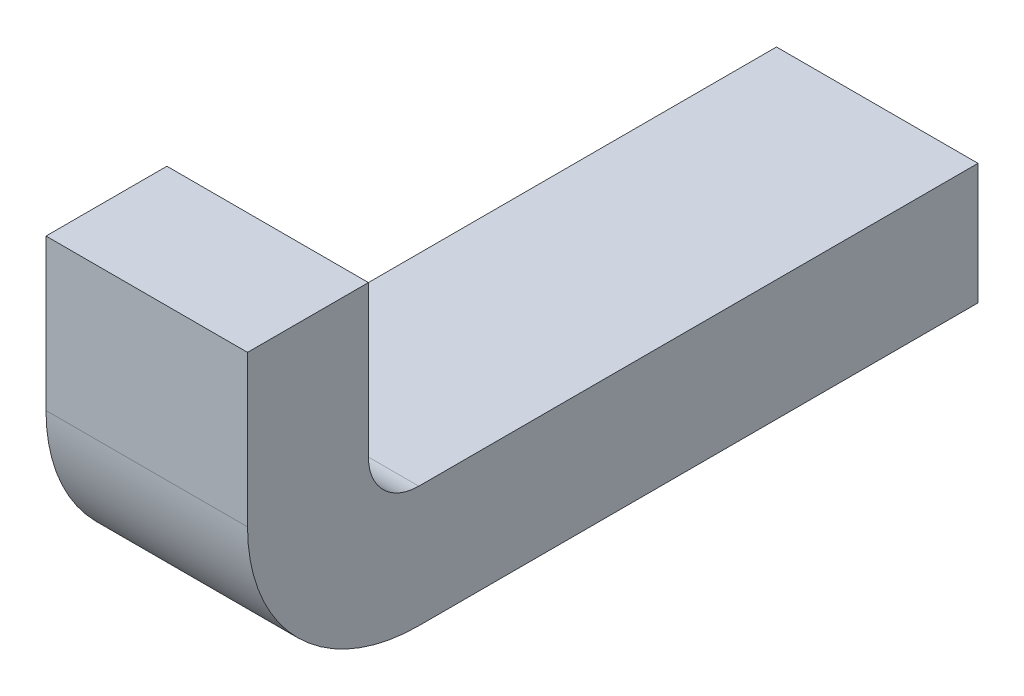
ISO-10303-21;
HEADER;
FILE_DESCRIPTION(('STEP AP214'),'2;1');
FILE_NAME('part.step','',(''),(''),'','','');
FILE_SCHEMA(('AUTOMOTIVE_DESIGN { 1 0 10303 214 1 1 1 1 }'));
ENDSEC;
DATA;
#1=APPLICATION_CONTEXT('core data for automotive mechanical design processes');
#2=APPLICATION_PROTOCOL_DEFINITION('international standard','automotive_design',2000,#1);
#3=PRODUCT_CONTEXT('',#1,'mechanical');
#4=PRODUCT('Part','Part','',(#3));
#5=PRODUCT_RELATED_PRODUCT_CATEGORY('part','',(#4));
#6=PRODUCT_DEFINITION_FORMATION('','',#4);
#7=PRODUCT_DEFINITION_CONTEXT('part definition',#1,'design');
#8=PRODUCT_DEFINITION('design','',#6,#7);
#9=PRODUCT_DEFINITION_SHAPE('','',#8);
#10=(LENGTH_UNIT() NAMED_UNIT(*) SI_UNIT(.MILLI.,.METRE.));
#11=(NAMED_UNIT(*) PLANE_ANGLE_UNIT() SI_UNIT($,.RADIAN.));
#12=(NAMED_UNIT(*) SI_UNIT($,.STERADIAN.) SOLID_ANGLE_UNIT());
#13=UNCERTAINTY_MEASURE_WITH_UNIT(LENGTH_MEASURE(1.E-05),#10,'distance_accuracy_value','');
#14=(GEOMETRIC_REPRESENTATION_CONTEXT(3) GLOBAL_UNCERTAINTY_ASSIGNED_CONTEXT((#13)) GLOBAL_UNIT_ASSIGNED_CONTEXT((#10,
#11,#12)) REPRESENTATION_CONTEXT('',''));
#15=CARTESIAN_POINT('',(0.,0.,0.));
#16=DIRECTION('',(0.,0.,1.));
#17=DIRECTION('',(1.,0.,0.));
#18=AXIS2_PLACEMENT_3D('',#15,#16,#17);
#19=CARTESIAN_POINT('',(3.21,0.17,-3.250000000002));
#20=DIRECTION('',(0.,0.,-1.));
#21=DIRECTION('',(-1.,0.,0.));
#22=AXIS2_PLACEMENT_3D('',#19,#20,#21);
#23=PLANE('',#22);
#24=DIRECTION('',(0.,1.,0.));
#25=VECTOR('',#24,1.);
#26=CARTESIAN_POINT('',(3.425,0.17,-3.250000000002));
#27=LINE('',#26,#25);
#28=CARTESIAN_POINT('',(3.425,0.17,-3.250000000002));
#29=VERTEX_POINT('',#28);
#30=CARTESIAN_POINT('',(3.425,0.32,-3.250000000002));
#31=VERTEX_POINT('',#30);
#32=EDGE_CURVE('E138',#29,#31,#27,.T.);
#33=ORIENTED_EDGE('',*,*,#32,.F.);
#34=DIRECTION('',(1.,0.,0.));
#35=VECTOR('',#34,1.);
#36=CARTESIAN_POINT('',(3.21,0.17,-3.250000000002));
#37=LINE('',#36,#35);
#38=CARTESIAN_POINT('',(3.225,0.17,-3.250000000002));
#39=VERTEX_POINT('',#38);
#40=EDGE_CURVE('E107',#29,#39,#37,.F.);
#41=ORIENTED_EDGE('',*,*,#40,.T.);
#42=DIRECTION('',(0.,1.,0.));
#43=VECTOR('',#42,1.);
#44=CARTESIAN_POINT('',(3.225,0.,-3.250000000002));
#45=LINE('',#44,#43);
#46=CARTESIAN_POINT('',(3.225,0.32,-3.250000000002));
#47=VERTEX_POINT('',#46);
#48=EDGE_CURVE('E104',#39,#47,#45,.T.);
#49=ORIENTED_EDGE('',*,*,#48,.T.);
#50=DIRECTION('',(1.,0.,0.));
#51=VECTOR('',#50,1.);
#52=CARTESIAN_POINT('',(3.21,0.32,-3.250000000002));
#53=LINE('',#52,#51);
#54=EDGE_CURVE('E131',#31,#47,#53,.F.);
#55=ORIENTED_EDGE('',*,*,#54,.F.);
#56=EDGE_LOOP('',(#33,#41,#49,#55));
#57=FACE_BOUND('',#56,.T.);
#58=ADVANCED_FACE('F16',(#57),#23,.T.);
#59=CARTESIAN_POINT('',(3.21,0.32,-3.250000000002));
#60=DIRECTION('',(0.,1.,1.246832498358E-13));
#61=DIRECTION('',(0.,-1.246832498358E-13,1.));
#62=AXIS2_PLACEMENT_3D('',#59,#60,#61);
#63=PLANE('',#62);
#64=DIRECTION('',(0.,0.,-1.));
#65=VECTOR('',#64,1.);
#66=CARTESIAN_POINT('',(3.425,0.32,-3.300000000002));
#67=LINE('',#66,#65);
#68=CARTESIAN_POINT('',(3.425,0.32,-3.130000000002));
#69=VERTEX_POINT('',#68);
#70=EDGE_CURVE('E134',#31,#69,#67,.F.);
#71=ORIENTED_EDGE('',*,*,#70,.F.);
#72=ORIENTED_EDGE('',*,*,#54,.T.);
#73=DIRECTION('',(0.,0.,1.));
#74=VECTOR('',#73,1.);
#75=CARTESIAN_POINT('',(3.225,0.32,3.855));
#76=LINE('',#75,#74);
#77=CARTESIAN_POINT('',(3.225,0.32,-3.130000000002));
#78=VERTEX_POINT('',#77);
#79=EDGE_CURVE('E98',#47,#78,#76,.T.);
#80=ORIENTED_EDGE('',*,*,#79,.T.);
#81=DIRECTION('',(1.,0.,0.));
#82=VECTOR('',#81,1.);
#83=CARTESIAN_POINT('',(3.21,0.32,-3.130000000002));
#84=LINE('',#83,#82);
#85=EDGE_CURVE('E129',#69,#78,#84,.F.);
#86=ORIENTED_EDGE('',*,*,#85,.F.);
#87=EDGE_LOOP('',(#71,#72,#80,#86));
#88=FACE_BOUND('',#87,.T.);
#89=ADVANCED_FACE('F188',(#88),#63,.T.);
#90=CARTESIAN_POINT('',(3.21,0.32,-3.130000000002));
#91=DIRECTION('',(0.,0.,1.));
#92=DIRECTION('',(1.,0.,0.));
#93=AXIS2_PLACEMENT_3D('',#90,#91,#92);
#94=PLANE('',#93);
#95=DIRECTION('',(0.,1.,0.));
#96=VECTOR('',#95,1.);
#97=CARTESIAN_POINT('',(3.425,0.17,-3.130000000002));
#98=LINE('',#97,#96);
#99=CARTESIAN_POINT('',(3.425,0.17,-3.130000000002));
#100=VERTEX_POINT('',#99);
#101=EDGE_CURVE('E137',#69,#100,#98,.F.);
#102=ORIENTED_EDGE('',*,*,#101,.F.);
#103=ORIENTED_EDGE('',*,*,#85,.T.);
#104=DIRECTION('',(0.,1.,0.));
#105=VECTOR('',#104,1.);
#106=CARTESIAN_POINT('',(3.225,0.,-3.130000000002));
#107=LINE('',#106,#105);
#108=CARTESIAN_POINT('',(3.225,0.17,-3.130000000002));
#109=VERTEX_POINT('',#108);
#110=EDGE_CURVE('E78',#78,#109,#107,.F.);
#111=ORIENTED_EDGE('',*,*,#110,.T.);
#112=DIRECTION('',(1.,0.,0.));
#113=VECTOR('',#112,1.);
#114=CARTESIAN_POINT('',(3.21,0.17,-3.130000000002));
#115=LINE('',#114,#113);
#116=EDGE_CURVE('E88',#100,#109,#115,.F.);
#117=ORIENTED_EDGE('',*,*,#116,.F.);
#118=EDGE_LOOP('',(#102,#103,#111,#117));
#119=FACE_BOUND('',#118,.T.);
#120=ADVANCED_FACE('F190',(#119),#94,.T.);
#121=CARTESIAN_POINT('',(3.21,0.17,-3.300000000002));
#122=DIRECTION('',(1.,0.,0.));
#123=DIRECTION('',(0.,0.,-1.));
#124=AXIS2_PLACEMENT_3D('',#121,#122,#123);
#125=CYLINDRICAL_SURFACE('',#124,0.17);
#126=CARTESIAN_POINT('',(3.425,0.17,-3.300000000002));
#127=DIRECTION('',(1.,0.,0.));
#128=DIRECTION('',(0.,0.,-1.));
#129=AXIS2_PLACEMENT_3D('',#126,#127,#128);
#130=CIRCLE('',#129,0.17);
#131=CARTESIAN_POINT('',(3.425,0.,-3.300000000002));
#132=VERTEX_POINT('',#131);
#133=EDGE_CURVE('E149',#100,#132,#130,.T.);
#134=ORIENTED_EDGE('',*,*,#133,.F.);
#135=ORIENTED_EDGE('',*,*,#116,.T.);
#136=CARTESIAN_POINT('',(3.225,0.17,-3.300000000002));
#137=DIRECTION('',(1.,0.,0.));
#138=DIRECTION('',(0.,0.,-1.));
#139=AXIS2_PLACEMENT_3D('',#136,#137,#138);
#140=CIRCLE('',#139,0.17);
#141=CARTESIAN_POINT('',(3.225,0.,-3.300000000002));
#142=VERTEX_POINT('',#141);
#143=EDGE_CURVE('E19',#109,#142,#140,.T.);
#144=ORIENTED_EDGE('',*,*,#143,.T.);
#145=DIRECTION('',(1.,0.,0.));
#146=VECTOR('',#145,1.);
#147=CARTESIAN_POINT('',(3.21,0.,-3.300000000002));
#148=LINE('',#147,#146);
#149=EDGE_CURVE('E86',#132,#142,#148,.F.);
#150=ORIENTED_EDGE('',*,*,#149,.F.);
#151=EDGE_LOOP('',(#134,#135,#144,#150));
#152=FACE_BOUND('',#151,.T.);
#153=ADVANCED_FACE('F85',(#152),#125,.T.);
#154=CARTESIAN_POINT('',(3.21,0.,-3.300000000002));
#155=DIRECTION('',(0.,-1.,0.));
#156=DIRECTION('',(0.,0.,-1.));
#157=AXIS2_PLACEMENT_3D('',#154,#155,#156);
#158=PLANE('',#157);
#159=DIRECTION('',(0.,0.,-1.));
#160=VECTOR('',#159,1.);
#161=CARTESIAN_POINT('',(3.425,0.,-3.300000000002));
#162=LINE('',#161,#160);
#163=CARTESIAN_POINT('',(3.425,0.,-3.854999999999));
#164=VERTEX_POINT('',#163);
#165=EDGE_CURVE('E96',#132,#164,#162,.T.);
#166=ORIENTED_EDGE('',*,*,#165,.F.);
#167=ORIENTED_EDGE('',*,*,#149,.T.);
#168=DIRECTION('',(0.,0.,1.));
#169=VECTOR('',#168,1.);
#170=CARTESIAN_POINT('',(3.225,0.,3.855));
#171=LINE('',#170,#169);
#172=CARTESIAN_POINT('',(3.225,0.,-3.854999999999));
#173=VERTEX_POINT('',#172);
#174=EDGE_CURVE('E91',#142,#173,#171,.F.);
#175=ORIENTED_EDGE('',*,*,#174,.T.);
#176=DIRECTION('',(-1.,0.,0.));
#177=VECTOR('',#176,1.);
#178=CARTESIAN_POINT('',(3.21,0.,-3.854999999999));
#179=LINE('',#178,#177);
#180=EDGE_CURVE('E121',#164,#173,#179,.T.);
#181=ORIENTED_EDGE('',*,*,#180,.F.);
#182=EDGE_LOOP('',(#166,#167,#175,#181));
#183=FACE_BOUND('',#182,.T.);
#184=ADVANCED_FACE('F93',(#183),#158,.T.);
#185=CARTESIAN_POINT('',(3.225,0.,3.855));
#186=DIRECTION('',(1.,0.,0.));
#187=DIRECTION('',(0.,1.,0.));
#188=AXIS2_PLACEMENT_3D('',#185,#186,#187);
#189=PLANE('',#188);
#190=CARTESIAN_POINT('',(3.225,0.17,-3.300000000002));
#191=DIRECTION('',(1.,0.,0.));
#192=DIRECTION('',(0.,0.,-1.));
#193=AXIS2_PLACEMENT_3D('',#190,#191,#192);
#194=CIRCLE('',#193,0.05);
#195=CARTESIAN_POINT('',(3.225,0.12,-3.300000000002));
#196=VERTEX_POINT('',#195);
#197=EDGE_CURVE('E126',#39,#196,#194,.T.);
#198=ORIENTED_EDGE('',*,*,#197,.T.);
#199=DIRECTION('',(0.,0.,1.));
#200=VECTOR('',#199,1.);
#201=CARTESIAN_POINT('',(3.225,0.12,-3.854999999999));
#202=LINE('',#201,#200);
#203=CARTESIAN_POINT('',(3.225,0.12,-3.854999999999));
#204=VERTEX_POINT('',#203);
#205=EDGE_CURVE('E123',#204,#196,#202,.T.);
#206=ORIENTED_EDGE('',*,*,#205,.F.);
#207=DIRECTION('',(0.,1.,0.));
#208=VECTOR('',#207,1.);
#209=CARTESIAN_POINT('',(3.225,0.,-3.854999999999));
#210=LINE('',#209,#208);
#211=EDGE_CURVE('E102',#173,#204,#210,.T.);
#212=ORIENTED_EDGE('',*,*,#211,.F.);
#213=ORIENTED_EDGE('',*,*,#174,.F.);
#214=ORIENTED_EDGE('',*,*,#143,.F.);
#215=ORIENTED_EDGE('',*,*,#110,.F.);
#216=ORIENTED_EDGE('',*,*,#79,.F.);
#217=ORIENTED_EDGE('',*,*,#48,.F.);
#218=EDGE_LOOP('',(#198,#206,#212,#213,#214,#215,#216,#217));
#219=FACE_BOUND('',#218,.T.);
#220=ADVANCED_FACE('F100',(#219),#189,.F.);
#221=CARTESIAN_POINT('',(3.21,0.17,-3.300000000002));
#222=DIRECTION('',(1.,0.,0.));
#223=DIRECTION('',(0.,0.,-1.));
#224=AXIS2_PLACEMENT_3D('',#221,#222,#223);
#225=CYLINDRICAL_SURFACE('',#224,0.05);
#226=ORIENTED_EDGE('',*,*,#40,.F.);
#227=CARTESIAN_POINT('',(3.425,0.17,-3.300000000002));
#228=DIRECTION('',(1.,0.,0.));
#229=DIRECTION('',(0.,0.,-1.));
#230=AXIS2_PLACEMENT_3D('',#227,#228,#229);
#231=CIRCLE('',#230,0.05);
#232=CARTESIAN_POINT('',(3.425,0.12,-3.300000000002));
#233=VERTEX_POINT('',#232);
#234=EDGE_CURVE('E118',#233,#29,#231,.F.);
#235=ORIENTED_EDGE('',*,*,#234,.F.);
#236=DIRECTION('',(1.,0.,0.));
#237=VECTOR('',#236,1.);
#238=CARTESIAN_POINT('',(3.21,0.12,-3.300000000002));
#239=LINE('',#238,#237);
#240=EDGE_CURVE('E161',#196,#233,#239,.T.);
#241=ORIENTED_EDGE('',*,*,#240,.F.);
#242=ORIENTED_EDGE('',*,*,#197,.F.);
#243=EDGE_LOOP('',(#226,#235,#241,#242));
#244=FACE_BOUND('',#243,.T.);
#245=ADVANCED_FACE('F183',(#244),#225,.F.);
#246=CARTESIAN_POINT('',(3.425,0.17,-3.300000000002));
#247=DIRECTION('',(1.,0.,0.));
#248=DIRECTION('',(0.,0.,-1.));
#249=AXIS2_PLACEMENT_3D('',#246,#247,#248);
#250=PLANE('',#249);
#251=DIRECTION('',(0.,0.,1.));
#252=VECTOR('',#251,1.);
#253=CARTESIAN_POINT('',(3.425,0.12,-3.854999999999));
#254=LINE('',#253,#252);
#255=CARTESIAN_POINT('',(3.425,0.12,-3.854999999999));
#256=VERTEX_POINT('',#255);
#257=EDGE_CURVE('E25',#233,#256,#254,.F.);
#258=ORIENTED_EDGE('',*,*,#257,.F.);
#259=ORIENTED_EDGE('',*,*,#234,.T.);
#260=ORIENTED_EDGE('',*,*,#32,.T.);
#261=ORIENTED_EDGE('',*,*,#70,.T.);
#262=ORIENTED_EDGE('',*,*,#101,.T.);
#263=ORIENTED_EDGE('',*,*,#133,.T.);
#264=ORIENTED_EDGE('',*,*,#165,.T.);
#265=DIRECTION('',(0.,1.,0.));
#266=VECTOR('',#265,1.);
#267=CARTESIAN_POINT('',(3.425,0.,-3.854999999999));
#268=LINE('',#267,#266);
#269=EDGE_CURVE('E34',#256,#164,#268,.F.);
#270=ORIENTED_EDGE('',*,*,#269,.F.);
#271=EDGE_LOOP('',(#258,#259,#260,#261,#262,#263,#264,#270));
#272=FACE_BOUND('',#271,.T.);
#273=ADVANCED_FACE('F180',(#272),#250,.T.);
#274=CARTESIAN_POINT('',(3.21,0.,-3.854999999999));
#275=DIRECTION('',(0.,0.,-1.));
#276=DIRECTION('',(-1.,0.,0.));
#277=AXIS2_PLACEMENT_3D('',#274,#275,#276);
#278=PLANE('',#277);
#279=ORIENTED_EDGE('',*,*,#269,.T.);
#280=ORIENTED_EDGE('',*,*,#180,.T.);
#281=ORIENTED_EDGE('',*,*,#211,.T.);
#282=DIRECTION('',(1.,0.,0.));
#283=VECTOR('',#282,1.);
#284=CARTESIAN_POINT('',(3.21,0.12,-3.854999999999));
#285=LINE('',#284,#283);
#286=EDGE_CURVE('E11',#256,#204,#285,.F.);
#287=ORIENTED_EDGE('',*,*,#286,.F.);
#288=EDGE_LOOP('',(#279,#280,#281,#287));
#289=FACE_BOUND('',#288,.T.);
#290=ADVANCED_FACE('F179',(#289),#278,.T.);
#291=CARTESIAN_POINT('',(3.21,0.12,-3.854999999999));
#292=DIRECTION('',(0.,1.,0.));
#293=DIRECTION('',(0.,0.,1.));
#294=AXIS2_PLACEMENT_3D('',#291,#292,#293);
#295=PLANE('',#294);
#296=ORIENTED_EDGE('',*,*,#257,.T.);
#297=ORIENTED_EDGE('',*,*,#286,.T.);
#298=ORIENTED_EDGE('',*,*,#205,.T.);
#299=ORIENTED_EDGE('',*,*,#240,.T.);
#300=EDGE_LOOP('',(#296,#297,#298,#299));
#301=FACE_BOUND('',#300,.T.);
#302=ADVANCED_FACE('F177',(#301),#295,.T.);
#303=CLOSED_SHELL('',(#58,#89,#120,#153,#184,#220,#245,#273,#290,#302));
#304=MANIFOLD_SOLID_BREP('B1',#303);
#305=ADVANCED_BREP_SHAPE_REPRESENTATION('',(#18,#304),#14);
#306=SHAPE_DEFINITION_REPRESENTATION(#9,#305);
ENDSEC;
END-ISO-10303-21;
